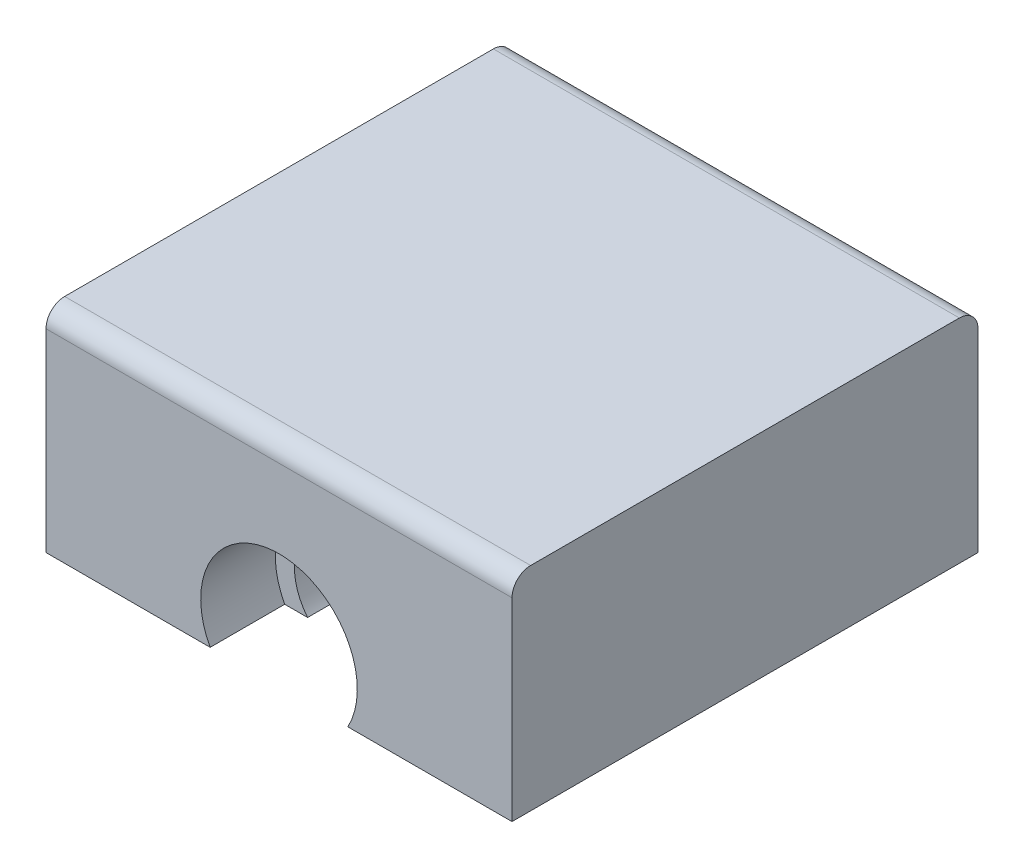
ISO-10303-21;
HEADER;
FILE_DESCRIPTION(('STEP AP214'),'2;1');
FILE_NAME('part.step','',(''),(''),'','','');
FILE_SCHEMA(('AUTOMOTIVE_DESIGN { 1 0 10303 214 1 1 1 1 }'));
ENDSEC;
DATA;
#1=APPLICATION_CONTEXT('core data for automotive mechanical design processes');
#2=APPLICATION_PROTOCOL_DEFINITION('international standard','automotive_design',2000,#1);
#3=PRODUCT_CONTEXT('',#1,'mechanical');
#4=PRODUCT('Part','Part','',(#3));
#5=PRODUCT_RELATED_PRODUCT_CATEGORY('part','',(#4));
#6=PRODUCT_DEFINITION_FORMATION('','',#4);
#7=PRODUCT_DEFINITION_CONTEXT('part definition',#1,'design');
#8=PRODUCT_DEFINITION('design','',#6,#7);
#9=PRODUCT_DEFINITION_SHAPE('','',#8);
#10=(LENGTH_UNIT() NAMED_UNIT(*) SI_UNIT(.MILLI.,.METRE.));
#11=(NAMED_UNIT(*) PLANE_ANGLE_UNIT() SI_UNIT($,.RADIAN.));
#12=(NAMED_UNIT(*) SI_UNIT($,.STERADIAN.) SOLID_ANGLE_UNIT());
#13=UNCERTAINTY_MEASURE_WITH_UNIT(LENGTH_MEASURE(1.E-05),#10,'distance_accuracy_value','');
#14=(GEOMETRIC_REPRESENTATION_CONTEXT(3) GLOBAL_UNCERTAINTY_ASSIGNED_CONTEXT((#13)) GLOBAL_UNIT_ASSIGNED_CONTEXT((#10,
#11,#12)) REPRESENTATION_CONTEXT('',''));
#15=CARTESIAN_POINT('',(0.,0.,0.));
#16=DIRECTION('',(0.,0.,1.));
#17=DIRECTION('',(1.,0.,0.));
#18=AXIS2_PLACEMENT_3D('',#15,#16,#17);
#19=CARTESIAN_POINT('',(0.,-1.,0.));
#20=DIRECTION('',(0.,-1.,0.));
#21=DIRECTION('',(0.,0.,-1.));
#22=AXIS2_PLACEMENT_3D('',#19,#20,#21);
#23=PLANE('',#22);
#24=DIRECTION('',(-1.,0.,0.));
#25=VECTOR('',#24,1.);
#26=CARTESIAN_POINT('',(-6.25,-1.,-6.25));
#27=LINE('',#26,#25);
#28=CARTESIAN_POINT('',(-1.84661853126194,-1.,-6.25));
#29=VERTEX_POINT('',#28);
#30=CARTESIAN_POINT('',(-6.25,-1.,-6.25));
#31=VERTEX_POINT('',#30);
#32=EDGE_CURVE('E152',#29,#31,#27,.T.);
#33=ORIENTED_EDGE('',*,*,#32,.F.);
#34=DIRECTION('',(0.,0.,-1.));
#35=VECTOR('',#34,1.);
#36=CARTESIAN_POINT('',(-1.84661853126194,-1.,-4.25));
#37=LINE('',#36,#35);
#38=CARTESIAN_POINT('',(-1.84661853126194,-1.,-4.25));
#39=VERTEX_POINT('',#38);
#40=EDGE_CURVE('E136',#29,#39,#37,.F.);
#41=ORIENTED_EDGE('',*,*,#40,.T.);
#42=DIRECTION('',(1.,0.,0.));
#43=VECTOR('',#42,1.);
#44=CARTESIAN_POINT('',(0.,-1.,-4.25));
#45=LINE('',#44,#43);
#46=CARTESIAN_POINT('',(-1.23294616670802,-1.,-4.25));
#47=VERTEX_POINT('',#46);
#48=EDGE_CURVE('E253',#39,#47,#45,.T.);
#49=ORIENTED_EDGE('',*,*,#48,.T.);
#50=DIRECTION('',(0.,0.,-1.));
#51=VECTOR('',#50,1.);
#52=CARTESIAN_POINT('',(-1.23294616670802,-1.,-2.25));
#53=LINE('',#52,#51);
#54=CARTESIAN_POINT('',(-1.23294616670802,-1.,-2.25));
#55=VERTEX_POINT('',#54);
#56=EDGE_CURVE('E206',#47,#55,#53,.F.);
#57=ORIENTED_EDGE('',*,*,#56,.T.);
#58=DIRECTION('',(1.,0.,0.));
#59=VECTOR('',#58,1.);
#60=CARTESIAN_POINT('',(0.,-1.,-2.25));
#61=LINE('',#60,#59);
#62=CARTESIAN_POINT('',(1.23294616670802,-1.,-2.25));
#63=VERTEX_POINT('',#62);
#64=EDGE_CURVE('E200',#55,#63,#61,.T.);
#65=ORIENTED_EDGE('',*,*,#64,.T.);
#66=DIRECTION('',(0.,0.,-1.));
#67=VECTOR('',#66,1.);
#68=CARTESIAN_POINT('',(1.23294616670802,-1.,-2.25));
#69=LINE('',#68,#67);
#70=CARTESIAN_POINT('',(1.23294616670802,-1.,-4.25));
#71=VERTEX_POINT('',#70);
#72=EDGE_CURVE('E203',#63,#71,#69,.T.);
#73=ORIENTED_EDGE('',*,*,#72,.T.);
#74=CARTESIAN_POINT('',(1.84661853126194,-1.,-4.25));
#75=VERTEX_POINT('',#74);
#76=EDGE_CURVE('E252',#71,#75,#45,.T.);
#77=ORIENTED_EDGE('',*,*,#76,.T.);
#78=DIRECTION('',(0.,0.,-1.));
#79=VECTOR('',#78,1.);
#80=CARTESIAN_POINT('',(1.84661853126194,-1.,-4.25));
#81=LINE('',#80,#79);
#82=CARTESIAN_POINT('',(1.84661853126194,-1.,-6.25));
#83=VERTEX_POINT('',#82);
#84=EDGE_CURVE('E147',#75,#83,#81,.T.);
#85=ORIENTED_EDGE('',*,*,#84,.T.);
#86=CARTESIAN_POINT('',(6.25,-1.,-6.25));
#87=VERTEX_POINT('',#86);
#88=EDGE_CURVE('E155',#87,#83,#27,.T.);
#89=ORIENTED_EDGE('',*,*,#88,.F.);
#90=DIRECTION('',(0.,0.,-1.));
#91=VECTOR('',#90,1.);
#92=CARTESIAN_POINT('',(6.25,-1.,6.25));
#93=LINE('',#92,#91);
#94=CARTESIAN_POINT('',(6.25,-1.,6.25));
#95=VERTEX_POINT('',#94);
#96=EDGE_CURVE('E160',#95,#87,#93,.T.);
#97=ORIENTED_EDGE('',*,*,#96,.F.);
#98=DIRECTION('',(1.,0.,0.));
#99=VECTOR('',#98,1.);
#100=CARTESIAN_POINT('',(-6.25,-1.,6.25));
#101=LINE('',#100,#99);
#102=CARTESIAN_POINT('',(1.84661853126194,-1.,6.25));
#103=VERTEX_POINT('',#102);
#104=EDGE_CURVE('E168',#103,#95,#101,.T.);
#105=ORIENTED_EDGE('',*,*,#104,.F.);
#106=DIRECTION('',(0.,0.,1.));
#107=VECTOR('',#106,1.);
#108=CARTESIAN_POINT('',(1.84661853126194,-1.,4.25));
#109=LINE('',#108,#107);
#110=CARTESIAN_POINT('',(1.84661853126194,-1.,4.25));
#111=VERTEX_POINT('',#110);
#112=EDGE_CURVE('E198',#111,#103,#109,.T.);
#113=ORIENTED_EDGE('',*,*,#112,.F.);
#114=DIRECTION('',(-1.,0.,0.));
#115=VECTOR('',#114,1.);
#116=CARTESIAN_POINT('',(0.,-1.,4.25));
#117=LINE('',#116,#115);
#118=CARTESIAN_POINT('',(1.23294616670802,-1.,4.25));
#119=VERTEX_POINT('',#118);
#120=EDGE_CURVE('E262',#111,#119,#117,.T.);
#121=ORIENTED_EDGE('',*,*,#120,.T.);
#122=DIRECTION('',(0.,0.,1.));
#123=VECTOR('',#122,1.);
#124=CARTESIAN_POINT('',(1.23294616670802,-1.,2.25));
#125=LINE('',#124,#123);
#126=CARTESIAN_POINT('',(1.23294616670802,-1.,2.25));
#127=VERTEX_POINT('',#126);
#128=EDGE_CURVE('E191',#127,#119,#125,.T.);
#129=ORIENTED_EDGE('',*,*,#128,.F.);
#130=DIRECTION('',(-1.,0.,0.));
#131=VECTOR('',#130,1.);
#132=CARTESIAN_POINT('',(0.,-1.,2.25));
#133=LINE('',#132,#131);
#134=CARTESIAN_POINT('',(-1.23294616670802,-1.,2.25));
#135=VERTEX_POINT('',#134);
#136=EDGE_CURVE('E186',#127,#135,#133,.T.);
#137=ORIENTED_EDGE('',*,*,#136,.T.);
#138=DIRECTION('',(0.,0.,1.));
#139=VECTOR('',#138,1.);
#140=CARTESIAN_POINT('',(-1.23294616670802,-1.,2.25));
#141=LINE('',#140,#139);
#142=CARTESIAN_POINT('',(-1.23294616670802,-1.,4.25));
#143=VERTEX_POINT('',#142);
#144=EDGE_CURVE('E189',#143,#135,#141,.F.);
#145=ORIENTED_EDGE('',*,*,#144,.F.);
#146=CARTESIAN_POINT('',(-1.84661853126194,-1.,4.25));
#147=VERTEX_POINT('',#146);
#148=EDGE_CURVE('E260',#143,#147,#117,.T.);
#149=ORIENTED_EDGE('',*,*,#148,.T.);
#150=DIRECTION('',(0.,0.,1.));
#151=VECTOR('',#150,1.);
#152=CARTESIAN_POINT('',(-1.84661853126194,-1.,4.25));
#153=LINE('',#152,#151);
#154=CARTESIAN_POINT('',(-1.84661853126194,-1.,6.25));
#155=VERTEX_POINT('',#154);
#156=EDGE_CURVE('E196',#155,#147,#153,.F.);
#157=ORIENTED_EDGE('',*,*,#156,.F.);
#158=CARTESIAN_POINT('',(-6.25,-1.,6.25));
#159=VERTEX_POINT('',#158);
#160=EDGE_CURVE('E169',#159,#155,#101,.T.);
#161=ORIENTED_EDGE('',*,*,#160,.F.);
#162=DIRECTION('',(0.,0.,1.));
#163=VECTOR('',#162,1.);
#164=CARTESIAN_POINT('',(-6.25,-1.,6.25));
#165=LINE('',#164,#163);
#166=EDGE_CURVE('E159',#31,#159,#165,.T.);
#167=ORIENTED_EDGE('',*,*,#166,.F.);
#168=EDGE_LOOP('',(#33,#41,#49,#57,#65,#73,#77,#85,#89,#97,#105,#113,#121,#129,#137,#145,#149,
#157,#161,#167));
#169=FACE_BOUND('',#168,.T.);
#170=ADVANCED_FACE('F35',(#169),#23,.T.);
#171=CARTESIAN_POINT('',(0.,0.,-2.25));
#172=DIRECTION('',(0.,0.,-1.));
#173=DIRECTION('',(-1.,0.,0.));
#174=AXIS2_PLACEMENT_3D('',#171,#172,#173);
#175=CYLINDRICAL_SURFACE('',#174,1.5875);
#176=ORIENTED_EDGE('',*,*,#56,.F.);
#177=CARTESIAN_POINT('',(0.,0.,-4.25));
#178=DIRECTION('',(0.,0.,-1.));
#179=DIRECTION('',(-1.,0.,0.));
#180=AXIS2_PLACEMENT_3D('',#177,#178,#179);
#181=CIRCLE('',#180,1.5875);
#182=EDGE_CURVE('E208',#47,#71,#181,.T.);
#183=ORIENTED_EDGE('',*,*,#182,.T.);
#184=ORIENTED_EDGE('',*,*,#72,.F.);
#185=CARTESIAN_POINT('',(0.,0.,-2.25));
#186=DIRECTION('',(0.,0.,1.));
#187=DIRECTION('',(1.,0.,0.));
#188=AXIS2_PLACEMENT_3D('',#185,#186,#187);
#189=CIRCLE('',#188,1.5875);
#190=EDGE_CURVE('E146',#63,#55,#189,.T.);
#191=ORIENTED_EDGE('',*,*,#190,.T.);
#192=EDGE_LOOP('',(#176,#183,#184,#191));
#193=FACE_BOUND('',#192,.T.);
#194=ADVANCED_FACE('F286',(#193),#175,.F.);
#195=CARTESIAN_POINT('',(0.,0.,2.25));
#196=DIRECTION('',(0.,0.,1.));
#197=DIRECTION('',(1.,0.,0.));
#198=AXIS2_PLACEMENT_3D('',#195,#196,#197);
#199=CYLINDRICAL_SURFACE('',#198,1.5875);
#200=CARTESIAN_POINT('',(0.,0.,4.25));
#201=DIRECTION('',(0.,0.,1.));
#202=DIRECTION('',(1.,0.,0.));
#203=AXIS2_PLACEMENT_3D('',#200,#201,#202);
#204=CIRCLE('',#203,1.5875);
#205=EDGE_CURVE('E194',#143,#119,#204,.F.);
#206=ORIENTED_EDGE('',*,*,#205,.F.);
#207=ORIENTED_EDGE('',*,*,#144,.T.);
#208=CARTESIAN_POINT('',(0.,0.,2.25));
#209=DIRECTION('',(0.,0.,1.));
#210=DIRECTION('',(1.,0.,0.));
#211=AXIS2_PLACEMENT_3D('',#208,#209,#210);
#212=CIRCLE('',#211,1.5875);
#213=EDGE_CURVE('E163',#127,#135,#212,.T.);
#214=ORIENTED_EDGE('',*,*,#213,.F.);
#215=ORIENTED_EDGE('',*,*,#128,.T.);
#216=EDGE_LOOP('',(#206,#207,#214,#215));
#217=FACE_BOUND('',#216,.T.);
#218=ADVANCED_FACE('F271',(#217),#199,.F.);
#219=CARTESIAN_POINT('',(6.25,4.7,6.25));
#220=DIRECTION('',(-1.,0.,0.));
#221=DIRECTION('',(0.,0.,1.));
#222=AXIS2_PLACEMENT_3D('',#219,#220,#221);
#223=PLANE('',#222);
#224=DIRECTION('',(0.,-1.,0.));
#225=VECTOR('',#224,1.);
#226=CARTESIAN_POINT('',(6.25,4.7,-6.25));
#227=LINE('',#226,#225);
#228=CARTESIAN_POINT('',(6.25,4.2,-6.25));
#229=VERTEX_POINT('',#228);
#230=EDGE_CURVE('E184',#229,#87,#227,.T.);
#231=ORIENTED_EDGE('',*,*,#230,.F.);
#232=CARTESIAN_POINT('',(6.25,4.2,-5.75));
#233=DIRECTION('',(-1.,0.,0.));
#234=DIRECTION('',(0.,0.,1.));
#235=AXIS2_PLACEMENT_3D('',#232,#233,#234);
#236=CIRCLE('',#235,0.5);
#237=CARTESIAN_POINT('',(6.25,4.7,-5.75));
#238=VERTEX_POINT('',#237);
#239=EDGE_CURVE('E43',#229,#238,#236,.F.);
#240=ORIENTED_EDGE('',*,*,#239,.T.);
#241=DIRECTION('',(0.,0.,-1.));
#242=VECTOR('',#241,1.);
#243=CARTESIAN_POINT('',(6.25,4.7,6.25));
#244=LINE('',#243,#242);
#245=CARTESIAN_POINT('',(6.25,4.7,5.75));
#246=VERTEX_POINT('',#245);
#247=EDGE_CURVE('E172',#246,#238,#244,.T.);
#248=ORIENTED_EDGE('',*,*,#247,.F.);
#249=CARTESIAN_POINT('',(6.25,4.2,5.75));
#250=DIRECTION('',(-1.,0.,0.));
#251=DIRECTION('',(0.,0.,1.));
#252=AXIS2_PLACEMENT_3D('',#249,#250,#251);
#253=CIRCLE('',#252,0.5);
#254=CARTESIAN_POINT('',(6.25,4.2,6.25));
#255=VERTEX_POINT('',#254);
#256=EDGE_CURVE('E50',#246,#255,#253,.F.);
#257=ORIENTED_EDGE('',*,*,#256,.T.);
#258=DIRECTION('',(0.,-1.,0.));
#259=VECTOR('',#258,1.);
#260=CARTESIAN_POINT('',(6.25,4.7,6.25));
#261=LINE('',#260,#259);
#262=EDGE_CURVE('E178',#255,#95,#261,.T.);
#263=ORIENTED_EDGE('',*,*,#262,.T.);
#264=ORIENTED_EDGE('',*,*,#96,.T.);
#265=EDGE_LOOP('',(#231,#240,#248,#257,#263,#264));
#266=FACE_BOUND('',#265,.T.);
#267=ADVANCED_FACE('F223',(#266),#223,.F.);
#268=CARTESIAN_POINT('',(-6.25,4.7,-6.25));
#269=DIRECTION('',(0.,0.,1.));
#270=DIRECTION('',(1.,0.,0.));
#271=AXIS2_PLACEMENT_3D('',#268,#269,#270);
#272=PLANE('',#271);
#273=DIRECTION('',(0.,-1.,0.));
#274=VECTOR('',#273,1.);
#275=CARTESIAN_POINT('',(-6.25,4.7,-6.25));
#276=LINE('',#275,#274);
#277=CARTESIAN_POINT('',(-6.25,4.2,-6.25));
#278=VERTEX_POINT('',#277);
#279=EDGE_CURVE('E182',#278,#31,#276,.T.);
#280=ORIENTED_EDGE('',*,*,#279,.F.);
#281=DIRECTION('',(-1.,0.,0.));
#282=VECTOR('',#281,1.);
#283=CARTESIAN_POINT('',(-6.25,4.2,-6.25));
#284=LINE('',#283,#282);
#285=EDGE_CURVE('E58',#278,#229,#284,.F.);
#286=ORIENTED_EDGE('',*,*,#285,.T.);
#287=ORIENTED_EDGE('',*,*,#230,.T.);
#288=ORIENTED_EDGE('',*,*,#88,.T.);
#289=CARTESIAN_POINT('',(0.,0.,-6.25));
#290=DIRECTION('',(0.,0.,1.));
#291=DIRECTION('',(1.,0.,0.));
#292=AXIS2_PLACEMENT_3D('',#289,#290,#291);
#293=CIRCLE('',#292,2.1);
#294=EDGE_CURVE('E139',#83,#29,#293,.T.);
#295=ORIENTED_EDGE('',*,*,#294,.T.);
#296=ORIENTED_EDGE('',*,*,#32,.T.);
#297=EDGE_LOOP('',(#280,#286,#287,#288,#295,#296));
#298=FACE_BOUND('',#297,.T.);
#299=ADVANCED_FACE('F151',(#298),#272,.F.);
#300=CARTESIAN_POINT('',(-6.25,4.7,6.25));
#301=DIRECTION('',(1.,0.,0.));
#302=DIRECTION('',(0.,0.,-1.));
#303=AXIS2_PLACEMENT_3D('',#300,#301,#302);
#304=PLANE('',#303);
#305=DIRECTION('',(0.,0.,1.));
#306=VECTOR('',#305,1.);
#307=CARTESIAN_POINT('',(-6.25,4.7,6.25));
#308=LINE('',#307,#306);
#309=CARTESIAN_POINT('',(-6.25,4.7,-5.75));
#310=VERTEX_POINT('',#309);
#311=CARTESIAN_POINT('',(-6.25,4.7,5.75));
#312=VERTEX_POINT('',#311);
#313=EDGE_CURVE('E175',#310,#312,#308,.T.);
#314=ORIENTED_EDGE('',*,*,#313,.F.);
#315=CARTESIAN_POINT('',(-6.25,4.2,-5.75));
#316=DIRECTION('',(1.,0.,0.));
#317=DIRECTION('',(0.,0.,-1.));
#318=AXIS2_PLACEMENT_3D('',#315,#316,#317);
#319=CIRCLE('',#318,0.5);
#320=EDGE_CURVE('E219',#310,#278,#319,.F.);
#321=ORIENTED_EDGE('',*,*,#320,.T.);
#322=ORIENTED_EDGE('',*,*,#279,.T.);
#323=ORIENTED_EDGE('',*,*,#166,.T.);
#324=DIRECTION('',(0.,-1.,0.));
#325=VECTOR('',#324,1.);
#326=CARTESIAN_POINT('',(-6.25,4.7,6.25));
#327=LINE('',#326,#325);
#328=CARTESIAN_POINT('',(-6.25,4.2,6.25));
#329=VERTEX_POINT('',#328);
#330=EDGE_CURVE('E180',#329,#159,#327,.T.);
#331=ORIENTED_EDGE('',*,*,#330,.F.);
#332=CARTESIAN_POINT('',(-6.25,4.2,5.75));
#333=DIRECTION('',(1.,0.,0.));
#334=DIRECTION('',(0.,0.,-1.));
#335=AXIS2_PLACEMENT_3D('',#332,#333,#334);
#336=CIRCLE('',#335,0.5);
#337=EDGE_CURVE('E217',#329,#312,#336,.F.);
#338=ORIENTED_EDGE('',*,*,#337,.T.);
#339=EDGE_LOOP('',(#314,#321,#322,#323,#331,#338));
#340=FACE_BOUND('',#339,.T.);
#341=ADVANCED_FACE('F232',(#340),#304,.F.);
#342=CARTESIAN_POINT('',(-6.25,4.7,6.25));
#343=DIRECTION('',(0.,0.,-1.));
#344=DIRECTION('',(-1.,0.,0.));
#345=AXIS2_PLACEMENT_3D('',#342,#343,#344);
#346=PLANE('',#345);
#347=ORIENTED_EDGE('',*,*,#262,.F.);
#348=DIRECTION('',(1.,0.,0.));
#349=VECTOR('',#348,1.);
#350=CARTESIAN_POINT('',(-6.25,4.2,6.25));
#351=LINE('',#350,#349);
#352=EDGE_CURVE('E11',#255,#329,#351,.F.);
#353=ORIENTED_EDGE('',*,*,#352,.T.);
#354=ORIENTED_EDGE('',*,*,#330,.T.);
#355=ORIENTED_EDGE('',*,*,#160,.T.);
#356=CARTESIAN_POINT('',(0.,0.,6.25));
#357=DIRECTION('',(0.,0.,1.));
#358=DIRECTION('',(1.,0.,0.));
#359=AXIS2_PLACEMENT_3D('',#356,#357,#358);
#360=CIRCLE('',#359,2.1);
#361=EDGE_CURVE('E243',#103,#155,#360,.T.);
#362=ORIENTED_EDGE('',*,*,#361,.F.);
#363=ORIENTED_EDGE('',*,*,#104,.T.);
#364=EDGE_LOOP('',(#347,#353,#354,#355,#362,#363));
#365=FACE_BOUND('',#364,.T.);
#366=ADVANCED_FACE('F238',(#365),#346,.F.);
#367=CARTESIAN_POINT('',(0.,4.7,0.));
#368=DIRECTION('',(0.,-1.,0.));
#369=DIRECTION('',(0.,0.,-1.));
#370=AXIS2_PLACEMENT_3D('',#367,#368,#369);
#371=PLANE('',#370);
#372=ORIENTED_EDGE('',*,*,#247,.T.);
#373=DIRECTION('',(-1.,0.,0.));
#374=VECTOR('',#373,1.);
#375=CARTESIAN_POINT('',(0.,4.7,-5.75));
#376=LINE('',#375,#374);
#377=EDGE_CURVE('E214',#238,#310,#376,.T.);
#378=ORIENTED_EDGE('',*,*,#377,.T.);
#379=ORIENTED_EDGE('',*,*,#313,.T.);
#380=DIRECTION('',(1.,0.,0.));
#381=VECTOR('',#380,1.);
#382=CARTESIAN_POINT('',(0.,4.7,5.75));
#383=LINE('',#382,#381);
#384=EDGE_CURVE('E211',#312,#246,#383,.T.);
#385=ORIENTED_EDGE('',*,*,#384,.T.);
#386=EDGE_LOOP('',(#372,#378,#379,#385));
#387=FACE_BOUND('',#386,.T.);
#388=ADVANCED_FACE('F227',(#387),#371,.F.);
#389=CARTESIAN_POINT('',(0.,0.,2.25));
#390=DIRECTION('',(0.,0.,1.));
#391=DIRECTION('',(1.,0.,0.));
#392=AXIS2_PLACEMENT_3D('',#389,#390,#391);
#393=PLANE('',#392);
#394=ORIENTED_EDGE('',*,*,#213,.T.);
#395=ORIENTED_EDGE('',*,*,#136,.F.);
#396=EDGE_LOOP('',(#394,#395));
#397=FACE_BOUND('',#396,.T.);
#398=ADVANCED_FACE('F273',(#397),#393,.T.);
#399=CARTESIAN_POINT('',(0.,0.,4.25));
#400=DIRECTION('',(0.,0.,1.));
#401=DIRECTION('',(1.,0.,0.));
#402=AXIS2_PLACEMENT_3D('',#399,#400,#401);
#403=CYLINDRICAL_SURFACE('',#402,2.1);
#404=ORIENTED_EDGE('',*,*,#112,.T.);
#405=ORIENTED_EDGE('',*,*,#361,.T.);
#406=ORIENTED_EDGE('',*,*,#156,.T.);
#407=CARTESIAN_POINT('',(0.,0.,4.25));
#408=DIRECTION('',(0.,0.,1.));
#409=DIRECTION('',(1.,0.,0.));
#410=AXIS2_PLACEMENT_3D('',#407,#408,#409);
#411=CIRCLE('',#410,2.1);
#412=EDGE_CURVE('E247',#111,#147,#411,.T.);
#413=ORIENTED_EDGE('',*,*,#412,.F.);
#414=EDGE_LOOP('',(#404,#405,#406,#413));
#415=FACE_BOUND('',#414,.T.);
#416=ADVANCED_FACE('F275',(#415),#403,.F.);
#417=CARTESIAN_POINT('',(0.,0.,4.25));
#418=DIRECTION('',(0.,0.,1.));
#419=DIRECTION('',(1.,0.,0.));
#420=AXIS2_PLACEMENT_3D('',#417,#418,#419);
#421=PLANE('',#420);
#422=ORIENTED_EDGE('',*,*,#412,.T.);
#423=ORIENTED_EDGE('',*,*,#148,.F.);
#424=ORIENTED_EDGE('',*,*,#205,.T.);
#425=ORIENTED_EDGE('',*,*,#120,.F.);
#426=EDGE_LOOP('',(#422,#423,#424,#425));
#427=FACE_BOUND('',#426,.T.);
#428=ADVANCED_FACE('F281',(#427),#421,.T.);
#429=CARTESIAN_POINT('',(0.,0.,-2.25));
#430=DIRECTION('',(0.,0.,-1.));
#431=DIRECTION('',(1.,0.,0.));
#432=AXIS2_PLACEMENT_3D('',#429,#430,#431);
#433=PLANE('',#432);
#434=ORIENTED_EDGE('',*,*,#190,.F.);
#435=ORIENTED_EDGE('',*,*,#64,.F.);
#436=EDGE_LOOP('',(#434,#435));
#437=FACE_BOUND('',#436,.T.);
#438=ADVANCED_FACE('F312',(#437),#433,.T.);
#439=CARTESIAN_POINT('',(0.,0.,-4.25));
#440=DIRECTION('',(0.,0.,-1.));
#441=DIRECTION('',(-1.,0.,0.));
#442=AXIS2_PLACEMENT_3D('',#439,#440,#441);
#443=CYLINDRICAL_SURFACE('',#442,2.1);
#444=ORIENTED_EDGE('',*,*,#294,.F.);
#445=ORIENTED_EDGE('',*,*,#84,.F.);
#446=CARTESIAN_POINT('',(0.,0.,-4.25));
#447=DIRECTION('',(0.,0.,1.));
#448=DIRECTION('',(1.,0.,0.));
#449=AXIS2_PLACEMENT_3D('',#446,#447,#448);
#450=CIRCLE('',#449,2.1);
#451=EDGE_CURVE('E142',#75,#39,#450,.T.);
#452=ORIENTED_EDGE('',*,*,#451,.T.);
#453=ORIENTED_EDGE('',*,*,#40,.F.);
#454=EDGE_LOOP('',(#444,#445,#452,#453));
#455=FACE_BOUND('',#454,.T.);
#456=ADVANCED_FACE('F138',(#455),#443,.F.);
#457=CARTESIAN_POINT('',(0.,0.,-4.25));
#458=DIRECTION('',(0.,0.,-1.));
#459=DIRECTION('',(1.,0.,0.));
#460=AXIS2_PLACEMENT_3D('',#457,#458,#459);
#461=PLANE('',#460);
#462=ORIENTED_EDGE('',*,*,#451,.F.);
#463=ORIENTED_EDGE('',*,*,#76,.F.);
#464=ORIENTED_EDGE('',*,*,#182,.F.);
#465=ORIENTED_EDGE('',*,*,#48,.F.);
#466=EDGE_LOOP('',(#462,#463,#464,#465));
#467=FACE_BOUND('',#466,.T.);
#468=ADVANCED_FACE('F302',(#467),#461,.T.);
#469=CARTESIAN_POINT('',(0.,4.2,-5.75));
#470=DIRECTION('',(-1.,0.,0.));
#471=DIRECTION('',(0.,0.,1.));
#472=AXIS2_PLACEMENT_3D('',#469,#470,#471);
#473=CYLINDRICAL_SURFACE('',#472,0.5);
#474=ORIENTED_EDGE('',*,*,#239,.F.);
#475=ORIENTED_EDGE('',*,*,#285,.F.);
#476=ORIENTED_EDGE('',*,*,#320,.F.);
#477=ORIENTED_EDGE('',*,*,#377,.F.);
#478=EDGE_LOOP('',(#474,#475,#476,#477));
#479=FACE_BOUND('',#478,.T.);
#480=ADVANCED_FACE('F230',(#479),#473,.T.);
#481=CARTESIAN_POINT('',(0.,4.2,5.75));
#482=DIRECTION('',(1.,0.,0.));
#483=DIRECTION('',(0.,0.,-1.));
#484=AXIS2_PLACEMENT_3D('',#481,#482,#483);
#485=CYLINDRICAL_SURFACE('',#484,0.5);
#486=ORIENTED_EDGE('',*,*,#337,.F.);
#487=ORIENTED_EDGE('',*,*,#352,.F.);
#488=ORIENTED_EDGE('',*,*,#256,.F.);
#489=ORIENTED_EDGE('',*,*,#384,.F.);
#490=EDGE_LOOP('',(#486,#487,#488,#489));
#491=FACE_BOUND('',#490,.T.);
#492=ADVANCED_FACE('F37',(#491),#485,.T.);
#493=CLOSED_SHELL('',(#170,#194,#218,#267,#299,#341,#366,#388,#398,#416,#428,#438,#456,#468,
#480,#492));
#494=MANIFOLD_SOLID_BREP('B2',#493);
#495=ADVANCED_BREP_SHAPE_REPRESENTATION('',(#18,#494),#14);
#496=SHAPE_DEFINITION_REPRESENTATION(#9,#495);
ENDSEC;
END-ISO-10303-21;
